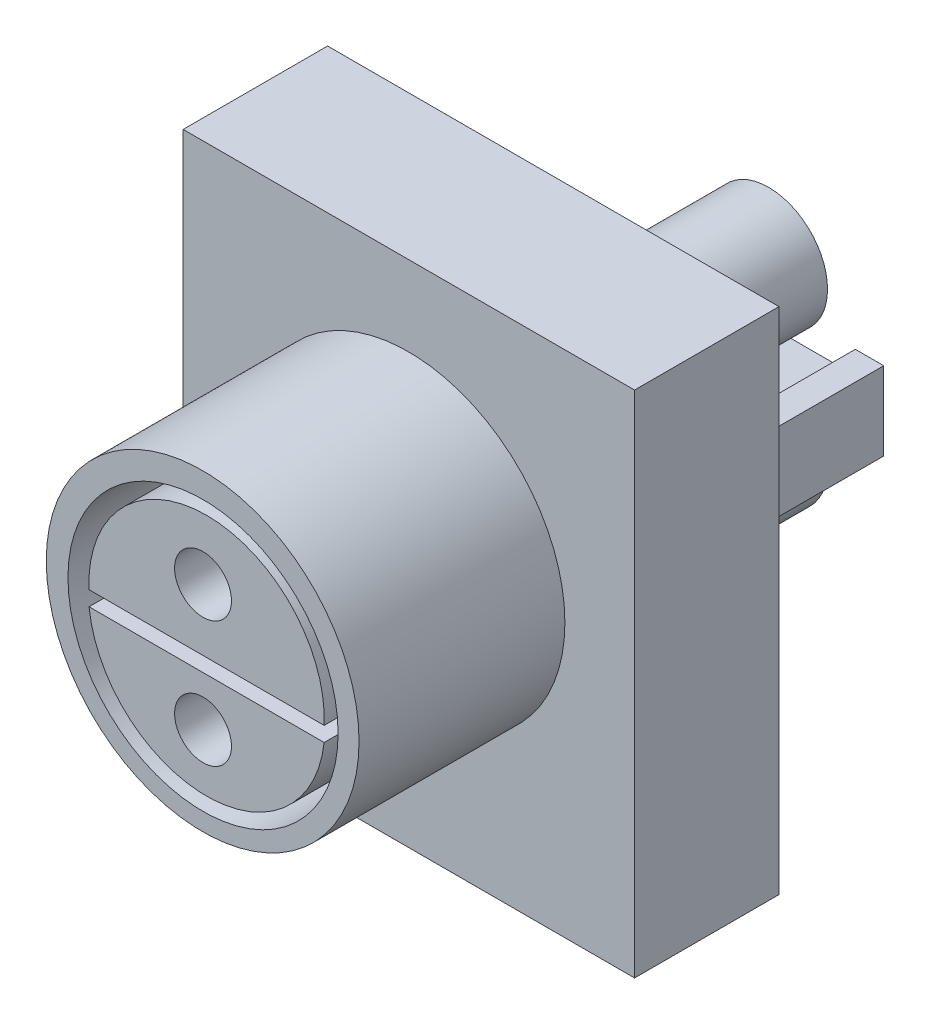
ISO-10303-21;
HEADER;
FILE_DESCRIPTION(('STEP AP214'),'2;1');
FILE_NAME('part.step','',(''),(''),'','','');
FILE_SCHEMA(('AUTOMOTIVE_DESIGN { 1 0 10303 214 1 1 1 1 }'));
ENDSEC;
DATA;
#1=APPLICATION_CONTEXT('core data for automotive mechanical design processes');
#2=APPLICATION_PROTOCOL_DEFINITION('international standard','automotive_design',2000,#1);
#3=PRODUCT_CONTEXT('',#1,'mechanical');
#4=PRODUCT('Part','Part','',(#3));
#5=PRODUCT_RELATED_PRODUCT_CATEGORY('part','',(#4));
#6=PRODUCT_DEFINITION_FORMATION('','',#4);
#7=PRODUCT_DEFINITION_CONTEXT('part definition',#1,'design');
#8=PRODUCT_DEFINITION('design','',#6,#7);
#9=PRODUCT_DEFINITION_SHAPE('','',#8);
#10=(LENGTH_UNIT() NAMED_UNIT(*) SI_UNIT(.MILLI.,.METRE.));
#11=(NAMED_UNIT(*) PLANE_ANGLE_UNIT() SI_UNIT($,.RADIAN.));
#12=(NAMED_UNIT(*) SI_UNIT($,.STERADIAN.) SOLID_ANGLE_UNIT());
#13=UNCERTAINTY_MEASURE_WITH_UNIT(LENGTH_MEASURE(1.E-05),#10,'distance_accuracy_value','');
#14=(GEOMETRIC_REPRESENTATION_CONTEXT(3) GLOBAL_UNCERTAINTY_ASSIGNED_CONTEXT((#13)) GLOBAL_UNIT_ASSIGNED_CONTEXT((#10,
#11,#12)) REPRESENTATION_CONTEXT('',''));
#15=CARTESIAN_POINT('',(0.,0.,0.));
#16=DIRECTION('',(0.,0.,1.));
#17=DIRECTION('',(1.,0.,0.));
#18=AXIS2_PLACEMENT_3D('',#15,#16,#17);
#19=CARTESIAN_POINT('',(-8.,-2.75,-15.24));
#20=DIRECTION('',(0.,1.,0.));
#21=DIRECTION('',(-1.,0.,0.));
#22=AXIS2_PLACEMENT_3D('',#19,#20,#21);
#23=PLANE('',#22);
#24=DIRECTION('',(0.,0.,1.));
#25=VECTOR('',#24,1.);
#26=CARTESIAN_POINT('',(-3.20212539960282,-2.75,-15.15));
#27=LINE('',#26,#25);
#28=CARTESIAN_POINT('',(-3.20212539960282,-2.75,0.));
#29=VERTEX_POINT('',#28);
#30=CARTESIAN_POINT('',(-3.20212539960282,-2.75,-0.0899999999999981));
#31=VERTEX_POINT('',#30);
#32=EDGE_CURVE('E57',#29,#31,#27,.F.);
#33=ORIENTED_EDGE('',*,*,#32,.F.);
#34=DIRECTION('',(-1.,0.,0.));
#35=VECTOR('',#34,1.);
#36=CARTESIAN_POINT('',(-8.,-2.75,0.));
#37=LINE('',#36,#35);
#38=CARTESIAN_POINT('',(-8.,-2.75,0.));
#39=VERTEX_POINT('',#38);
#40=EDGE_CURVE('E363',#29,#39,#37,.T.);
#41=ORIENTED_EDGE('',*,*,#40,.T.);
#42=DIRECTION('',(0.,0.,1.));
#43=VECTOR('',#42,1.);
#44=CARTESIAN_POINT('',(-8.,-2.75,-15.24));
#45=LINE('',#44,#43);
#46=CARTESIAN_POINT('',(-8.,-2.75,-15.24));
#47=VERTEX_POINT('',#46);
#48=EDGE_CURVE('E376',#47,#39,#45,.T.);
#49=ORIENTED_EDGE('',*,*,#48,.F.);
#50=DIRECTION('',(-1.,0.,0.));
#51=VECTOR('',#50,1.);
#52=CARTESIAN_POINT('',(-8.,-2.75,-15.24));
#53=LINE('',#52,#51);
#54=CARTESIAN_POINT('',(-6.,-2.75,-15.24));
#55=VERTEX_POINT('',#54);
#56=EDGE_CURVE('E349',#55,#47,#53,.T.);
#57=ORIENTED_EDGE('',*,*,#56,.F.);
#58=DIRECTION('',(0.,0.,-1.));
#59=VECTOR('',#58,1.);
#60=CARTESIAN_POINT('',(-6.,-2.75,-0.0899999999999981));
#61=LINE('',#60,#59);
#62=CARTESIAN_POINT('',(-6.,-2.75,-0.0899999999999981));
#63=VERTEX_POINT('',#62);
#64=EDGE_CURVE('E248',#63,#55,#61,.T.);
#65=ORIENTED_EDGE('',*,*,#64,.F.);
#66=DIRECTION('',(-1.,0.,0.));
#67=VECTOR('',#66,1.);
#68=CARTESIAN_POINT('',(-6.,-2.75,-0.0899999999999981));
#69=LINE('',#68,#67);
#70=EDGE_CURVE('E213',#31,#63,#69,.T.);
#71=ORIENTED_EDGE('',*,*,#70,.F.);
#72=EDGE_LOOP('',(#33,#41,#49,#57,#65,#71));
#73=FACE_BOUND('',#72,.T.);
#74=ADVANCED_FACE('F42',(#73),#23,.F.);
#75=DIRECTION('',(0.,0.,1.));
#76=VECTOR('',#75,1.);
#77=CARTESIAN_POINT('',(3.20212539960282,-2.75,-15.15));
#78=LINE('',#77,#76);
#79=CARTESIAN_POINT('',(3.20212539960282,-2.75,-0.0899999999999981));
#80=VERTEX_POINT('',#79);
#81=CARTESIAN_POINT('',(3.20212539960282,-2.75,0.));
#82=VERTEX_POINT('',#81);
#83=EDGE_CURVE('E216',#80,#82,#78,.T.);
#84=ORIENTED_EDGE('',*,*,#83,.F.);
#85=CARTESIAN_POINT('',(6.,-2.75,-0.0899999999999981));
#86=VERTEX_POINT('',#85);
#87=EDGE_CURVE('E204',#86,#80,#69,.T.);
#88=ORIENTED_EDGE('',*,*,#87,.F.);
#89=DIRECTION('',(0.,0.,-1.));
#90=VECTOR('',#89,1.);
#91=CARTESIAN_POINT('',(6.,-2.75,-0.0899999999999981));
#92=LINE('',#91,#90);
#93=CARTESIAN_POINT('',(6.,-2.75,-15.24));
#94=VERTEX_POINT('',#93);
#95=EDGE_CURVE('E256',#86,#94,#92,.T.);
#96=ORIENTED_EDGE('',*,*,#95,.T.);
#97=CARTESIAN_POINT('',(8.,-2.75,-15.24));
#98=VERTEX_POINT('',#97);
#99=EDGE_CURVE('E351',#98,#94,#53,.T.);
#100=ORIENTED_EDGE('',*,*,#99,.F.);
#101=DIRECTION('',(0.,0.,1.));
#102=VECTOR('',#101,1.);
#103=CARTESIAN_POINT('',(8.,-2.75,-15.24));
#104=LINE('',#103,#102);
#105=CARTESIAN_POINT('',(8.,-2.75,0.));
#106=VERTEX_POINT('',#105);
#107=EDGE_CURVE('E379',#98,#106,#104,.T.);
#108=ORIENTED_EDGE('',*,*,#107,.T.);
#109=EDGE_CURVE('E219',#106,#82,#37,.T.);
#110=ORIENTED_EDGE('',*,*,#109,.T.);
#111=EDGE_LOOP('',(#84,#88,#96,#100,#108,#110));
#112=FACE_BOUND('',#111,.T.);
#113=ADVANCED_FACE('F217',(#112),#23,.F.);
#114=CARTESIAN_POINT('',(-8.,2.75,-15.24));
#115=DIRECTION('',(0.,-1.,0.));
#116=DIRECTION('',(1.,0.,0.));
#117=AXIS2_PLACEMENT_3D('',#114,#115,#116);
#118=PLANE('',#117);
#119=DIRECTION('',(0.,0.,1.));
#120=VECTOR('',#119,1.);
#121=CARTESIAN_POINT('',(3.06791110155859,2.75,-15.15));
#122=LINE('',#121,#120);
#123=CARTESIAN_POINT('',(3.06791110155859,2.75,0.));
#124=VERTEX_POINT('',#123);
#125=CARTESIAN_POINT('',(3.06791110155859,2.75,-0.0899999999999981));
#126=VERTEX_POINT('',#125);
#127=EDGE_CURVE('E240',#124,#126,#122,.F.);
#128=ORIENTED_EDGE('',*,*,#127,.F.);
#129=DIRECTION('',(1.,0.,0.));
#130=VECTOR('',#129,1.);
#131=CARTESIAN_POINT('',(-8.,2.75,0.));
#132=LINE('',#131,#130);
#133=CARTESIAN_POINT('',(8.,2.75,0.));
#134=VERTEX_POINT('',#133);
#135=EDGE_CURVE('E368',#124,#134,#132,.T.);
#136=ORIENTED_EDGE('',*,*,#135,.T.);
#137=DIRECTION('',(0.,0.,1.));
#138=VECTOR('',#137,1.);
#139=CARTESIAN_POINT('',(8.,2.75,-15.24));
#140=LINE('',#139,#138);
#141=CARTESIAN_POINT('',(8.,2.75,-15.24));
#142=VERTEX_POINT('',#141);
#143=EDGE_CURVE('E360',#142,#134,#140,.T.);
#144=ORIENTED_EDGE('',*,*,#143,.F.);
#145=DIRECTION('',(1.,0.,0.));
#146=VECTOR('',#145,1.);
#147=CARTESIAN_POINT('',(-8.,2.75,-15.24));
#148=LINE('',#147,#146);
#149=CARTESIAN_POINT('',(6.,2.75,-15.24));
#150=VERTEX_POINT('',#149);
#151=EDGE_CURVE('E356',#150,#142,#148,.T.);
#152=ORIENTED_EDGE('',*,*,#151,.F.);
#153=DIRECTION('',(0.,0.,-1.));
#154=VECTOR('',#153,1.);
#155=CARTESIAN_POINT('',(6.,2.75,-0.0899999999999981));
#156=LINE('',#155,#154);
#157=CARTESIAN_POINT('',(6.,2.75,-0.0899999999999981));
#158=VERTEX_POINT('',#157);
#159=EDGE_CURVE('E277',#158,#150,#156,.T.);
#160=ORIENTED_EDGE('',*,*,#159,.F.);
#161=DIRECTION('',(1.,0.,0.));
#162=VECTOR('',#161,1.);
#163=CARTESIAN_POINT('',(-6.,2.75,-0.0899999999999981));
#164=LINE('',#163,#162);
#165=EDGE_CURVE('E268',#126,#158,#164,.T.);
#166=ORIENTED_EDGE('',*,*,#165,.F.);
#167=EDGE_LOOP('',(#128,#136,#144,#152,#160,#166));
#168=FACE_BOUND('',#167,.T.);
#169=ADVANCED_FACE('F427',(#168),#118,.F.);
#170=DIRECTION('',(0.,0.,1.));
#171=VECTOR('',#170,1.);
#172=CARTESIAN_POINT('',(-3.06791110155859,2.75,-15.15));
#173=LINE('',#172,#171);
#174=CARTESIAN_POINT('',(-3.06791110155859,2.75,-0.0899999999999981));
#175=VERTEX_POINT('',#174);
#176=CARTESIAN_POINT('',(-3.06791110155859,2.75,0.));
#177=VERTEX_POINT('',#176);
#178=EDGE_CURVE('E237',#175,#177,#173,.T.);
#179=ORIENTED_EDGE('',*,*,#178,.F.);
#180=CARTESIAN_POINT('',(-6.,2.75,-0.0899999999999981));
#181=VERTEX_POINT('',#180);
#182=EDGE_CURVE('E264',#181,#175,#164,.T.);
#183=ORIENTED_EDGE('',*,*,#182,.F.);
#184=DIRECTION('',(0.,0.,-1.));
#185=VECTOR('',#184,1.);
#186=CARTESIAN_POINT('',(-6.,2.75,-0.0899999999999981));
#187=LINE('',#186,#185);
#188=CARTESIAN_POINT('',(-6.,2.75,-15.24));
#189=VERTEX_POINT('',#188);
#190=EDGE_CURVE('E285',#181,#189,#187,.T.);
#191=ORIENTED_EDGE('',*,*,#190,.T.);
#192=CARTESIAN_POINT('',(-8.,2.75,-15.24));
#193=VERTEX_POINT('',#192);
#194=EDGE_CURVE('E357',#193,#189,#148,.T.);
#195=ORIENTED_EDGE('',*,*,#194,.F.);
#196=DIRECTION('',(0.,0.,1.));
#197=VECTOR('',#196,1.);
#198=CARTESIAN_POINT('',(-8.,2.75,-15.24));
#199=LINE('',#198,#197);
#200=CARTESIAN_POINT('',(-8.,2.75,0.));
#201=VERTEX_POINT('',#200);
#202=EDGE_CURVE('E373',#193,#201,#199,.T.);
#203=ORIENTED_EDGE('',*,*,#202,.T.);
#204=EDGE_CURVE('E350',#201,#177,#132,.T.);
#205=ORIENTED_EDGE('',*,*,#204,.T.);
#206=EDGE_LOOP('',(#179,#183,#191,#195,#203,#205));
#207=FACE_BOUND('',#206,.T.);
#208=ADVANCED_FACE('F447',(#207),#118,.F.);
#209=CARTESIAN_POINT('',(0.,0.,0.));
#210=DIRECTION('',(0.,0.,1.));
#211=DIRECTION('',(1.,0.,0.));
#212=AXIS2_PLACEMENT_3D('',#209,#210,#211);
#213=PLANE('',#212);
#214=CARTESIAN_POINT('',(0.,-5.36622207108236,0.));
#215=DIRECTION('',(0.,0.,-1.));
#216=DIRECTION('',(-1.,0.,0.));
#217=AXIS2_PLACEMENT_3D('',#214,#215,#216);
#218=CIRCLE('',#217,4.135);
#219=EDGE_CURVE('E64',#82,#29,#218,.T.);
#220=ORIENTED_EDGE('',*,*,#219,.F.);
#221=ORIENTED_EDGE('',*,*,#109,.F.);
#222=DIRECTION('',(0.,-1.,0.));
#223=VECTOR('',#222,1.);
#224=CARTESIAN_POINT('',(8.,-2.75,0.));
#225=LINE('',#224,#223);
#226=EDGE_CURVE('E343',#134,#106,#225,.T.);
#227=ORIENTED_EDGE('',*,*,#226,.F.);
#228=ORIENTED_EDGE('',*,*,#135,.F.);
#229=CARTESIAN_POINT('',(0.,5.52355462633182,0.));
#230=DIRECTION('',(0.,0.,-1.));
#231=DIRECTION('',(-1.,0.,0.));
#232=AXIS2_PLACEMENT_3D('',#229,#230,#231);
#233=CIRCLE('',#232,4.13578091686601);
#234=EDGE_CURVE('E232',#177,#124,#233,.T.);
#235=ORIENTED_EDGE('',*,*,#234,.F.);
#236=ORIENTED_EDGE('',*,*,#204,.F.);
#237=DIRECTION('',(0.,1.,0.));
#238=VECTOR('',#237,1.);
#239=CARTESIAN_POINT('',(-8.,-2.75,0.));
#240=LINE('',#239,#238);
#241=EDGE_CURVE('E365',#39,#201,#240,.T.);
#242=ORIENTED_EDGE('',*,*,#241,.F.);
#243=ORIENTED_EDGE('',*,*,#40,.F.);
#244=EDGE_LOOP('',(#220,#221,#227,#228,#235,#236,#242,#243));
#245=FACE_BOUND('',#244,.T.);
#246=DIRECTION('',(0.,-1.,0.));
#247=VECTOR('',#246,1.);
#248=CARTESIAN_POINT('',(-15.875,-17.907,0.));
#249=LINE('',#248,#247);
#250=CARTESIAN_POINT('',(-15.875,17.907,0.));
#251=VERTEX_POINT('',#250);
#252=CARTESIAN_POINT('',(-15.875,-17.907,0.));
#253=VERTEX_POINT('',#252);
#254=EDGE_CURVE('E384',#251,#253,#249,.T.);
#255=ORIENTED_EDGE('',*,*,#254,.F.);
#256=DIRECTION('',(-1.,0.,0.));
#257=VECTOR('',#256,1.);
#258=CARTESIAN_POINT('',(15.875,17.907,0.));
#259=LINE('',#258,#257);
#260=CARTESIAN_POINT('',(15.875,17.907,0.));
#261=VERTEX_POINT('',#260);
#262=EDGE_CURVE('E393',#261,#251,#259,.T.);
#263=ORIENTED_EDGE('',*,*,#262,.F.);
#264=DIRECTION('',(0.,1.,0.));
#265=VECTOR('',#264,1.);
#266=CARTESIAN_POINT('',(15.875,-17.907,0.));
#267=LINE('',#266,#265);
#268=CARTESIAN_POINT('',(15.875,-17.907,0.));
#269=VERTEX_POINT('',#268);
#270=EDGE_CURVE('E404',#269,#261,#267,.T.);
#271=ORIENTED_EDGE('',*,*,#270,.F.);
#272=DIRECTION('',(1.,0.,0.));
#273=VECTOR('',#272,1.);
#274=CARTESIAN_POINT('',(15.875,-17.907,0.));
#275=LINE('',#274,#273);
#276=EDGE_CURVE('E402',#253,#269,#275,.T.);
#277=ORIENTED_EDGE('',*,*,#276,.F.);
#278=EDGE_LOOP('',(#255,#263,#271,#277));
#279=FACE_BOUND('',#278,.T.);
#280=ADVANCED_FACE('F457',(#245,#279),#213,.F.);
#281=CARTESIAN_POINT('',(-15.875,-17.907,10.16));
#282=DIRECTION('',(1.,0.,0.));
#283=DIRECTION('',(0.,0.,-1.));
#284=AXIS2_PLACEMENT_3D('',#281,#282,#283);
#285=PLANE('',#284);
#286=ORIENTED_EDGE('',*,*,#254,.T.);
#287=DIRECTION('',(0.,0.,-1.));
#288=VECTOR('',#287,1.);
#289=CARTESIAN_POINT('',(-15.875,-17.907,10.16));
#290=LINE('',#289,#288);
#291=CARTESIAN_POINT('',(-15.875,-17.907,10.16));
#292=VERTEX_POINT('',#291);
#293=EDGE_CURVE('E388',#292,#253,#290,.T.);
#294=ORIENTED_EDGE('',*,*,#293,.F.);
#295=DIRECTION('',(0.,-1.,0.));
#296=VECTOR('',#295,1.);
#297=CARTESIAN_POINT('',(-15.875,-17.907,10.16));
#298=LINE('',#297,#296);
#299=CARTESIAN_POINT('',(-15.875,17.907,10.16));
#300=VERTEX_POINT('',#299);
#301=EDGE_CURVE('E389',#300,#292,#298,.T.);
#302=ORIENTED_EDGE('',*,*,#301,.F.);
#303=DIRECTION('',(0.,0.,-1.));
#304=VECTOR('',#303,1.);
#305=CARTESIAN_POINT('',(-15.875,17.907,10.16));
#306=LINE('',#305,#304);
#307=EDGE_CURVE('E399',#300,#251,#306,.T.);
#308=ORIENTED_EDGE('',*,*,#307,.T.);
#309=EDGE_LOOP('',(#286,#294,#302,#308));
#310=FACE_BOUND('',#309,.T.);
#311=ADVANCED_FACE('F44',(#310),#285,.F.);
#312=CARTESIAN_POINT('',(15.875,-17.907,10.16));
#313=DIRECTION('',(0.,1.,0.));
#314=DIRECTION('',(-1.,0.,0.));
#315=AXIS2_PLACEMENT_3D('',#312,#313,#314);
#316=PLANE('',#315);
#317=ORIENTED_EDGE('',*,*,#276,.T.);
#318=DIRECTION('',(0.,0.,-1.));
#319=VECTOR('',#318,1.);
#320=CARTESIAN_POINT('',(15.875,-17.907,10.16));
#321=LINE('',#320,#319);
#322=CARTESIAN_POINT('',(15.875,-17.907,10.16));
#323=VERTEX_POINT('',#322);
#324=EDGE_CURVE('E412',#323,#269,#321,.T.);
#325=ORIENTED_EDGE('',*,*,#324,.F.);
#326=DIRECTION('',(1.,0.,0.));
#327=VECTOR('',#326,1.);
#328=CARTESIAN_POINT('',(15.875,-17.907,10.16));
#329=LINE('',#328,#327);
#330=EDGE_CURVE('E392',#292,#323,#329,.T.);
#331=ORIENTED_EDGE('',*,*,#330,.F.);
#332=ORIENTED_EDGE('',*,*,#293,.T.);
#333=EDGE_LOOP('',(#317,#325,#331,#332));
#334=FACE_BOUND('',#333,.T.);
#335=ADVANCED_FACE('F509',(#334),#316,.F.);
#336=CARTESIAN_POINT('',(15.875,-17.907,10.16));
#337=DIRECTION('',(-1.,0.,0.));
#338=DIRECTION('',(0.,0.,1.));
#339=AXIS2_PLACEMENT_3D('',#336,#337,#338);
#340=PLANE('',#339);
#341=ORIENTED_EDGE('',*,*,#270,.T.);
#342=DIRECTION('',(0.,0.,-1.));
#343=VECTOR('',#342,1.);
#344=CARTESIAN_POINT('',(15.875,17.907,10.16));
#345=LINE('',#344,#343);
#346=CARTESIAN_POINT('',(15.875,17.907,10.16));
#347=VERTEX_POINT('',#346);
#348=EDGE_CURVE('E409',#347,#261,#345,.T.);
#349=ORIENTED_EDGE('',*,*,#348,.F.);
#350=DIRECTION('',(0.,1.,0.));
#351=VECTOR('',#350,1.);
#352=CARTESIAN_POINT('',(15.875,-17.907,10.16));
#353=LINE('',#352,#351);
#354=EDGE_CURVE('E395',#323,#347,#353,.T.);
#355=ORIENTED_EDGE('',*,*,#354,.F.);
#356=ORIENTED_EDGE('',*,*,#324,.T.);
#357=EDGE_LOOP('',(#341,#349,#355,#356));
#358=FACE_BOUND('',#357,.T.);
#359=ADVANCED_FACE('F506',(#358),#340,.F.);
#360=CARTESIAN_POINT('',(15.875,17.907,10.16));
#361=DIRECTION('',(0.,-1.,0.));
#362=DIRECTION('',(1.,0.,0.));
#363=AXIS2_PLACEMENT_3D('',#360,#361,#362);
#364=PLANE('',#363);
#365=ORIENTED_EDGE('',*,*,#262,.T.);
#366=ORIENTED_EDGE('',*,*,#307,.F.);
#367=DIRECTION('',(-1.,0.,0.));
#368=VECTOR('',#367,1.);
#369=CARTESIAN_POINT('',(15.875,17.907,10.16));
#370=LINE('',#369,#368);
#371=EDGE_CURVE('E397',#347,#300,#370,.T.);
#372=ORIENTED_EDGE('',*,*,#371,.F.);
#373=ORIENTED_EDGE('',*,*,#348,.T.);
#374=EDGE_LOOP('',(#365,#366,#372,#373));
#375=FACE_BOUND('',#374,.T.);
#376=ADVANCED_FACE('F500',(#375),#364,.F.);
#377=CARTESIAN_POINT('',(0.,0.,10.16));
#378=DIRECTION('',(0.,0.,1.));
#379=DIRECTION('',(1.,0.,0.));
#380=AXIS2_PLACEMENT_3D('',#377,#378,#379);
#381=PLANE('',#380);
#382=CARTESIAN_POINT('',(-0.0248242021001488,1.28910760786738,10.16));
#383=DIRECTION('',(0.,0.,1.));
#384=DIRECTION('',(1.,0.,0.));
#385=AXIS2_PLACEMENT_3D('',#382,#383,#384);
#386=CIRCLE('',#385,11.);
#387=CARTESIAN_POINT('',(10.9751757978999,1.28910760786738,10.16));
#388=VERTEX_POINT('',#387);
#389=EDGE_CURVE('E385',#388,#388,#386,.T.);
#390=ORIENTED_EDGE('',*,*,#389,.F.);
#391=EDGE_LOOP('',(#390));
#392=FACE_BOUND('',#391,.T.);
#393=ORIENTED_EDGE('',*,*,#301,.T.);
#394=ORIENTED_EDGE('',*,*,#330,.T.);
#395=ORIENTED_EDGE('',*,*,#354,.T.);
#396=ORIENTED_EDGE('',*,*,#371,.T.);
#397=EDGE_LOOP('',(#393,#394,#395,#396));
#398=FACE_BOUND('',#397,.T.);
#399=ADVANCED_FACE('F496',(#392,#398),#381,.T.);
#400=CARTESIAN_POINT('',(-0.0248242021001488,1.28910760786738,24.638));
#401=DIRECTION('',(0.,0.,-1.));
#402=DIRECTION('',(-1.,0.,0.));
#403=AXIS2_PLACEMENT_3D('',#400,#401,#402);
#404=CYLINDRICAL_SURFACE('',#403,11.);
#405=CARTESIAN_POINT('',(-0.0248242021001488,1.28910760786738,24.638));
#406=DIRECTION('',(0.,0.,1.));
#407=DIRECTION('',(1.,0.,0.));
#408=AXIS2_PLACEMENT_3D('',#405,#406,#407);
#409=CIRCLE('',#408,11.);
#410=CARTESIAN_POINT('',(10.9751757978999,1.28910760786738,24.638));
#411=VERTEX_POINT('',#410);
#412=EDGE_CURVE('E381',#411,#411,#409,.T.);
#413=ORIENTED_EDGE('',*,*,#412,.F.);
#414=EDGE_LOOP('',(#413));
#415=FACE_BOUND('',#414,.T.);
#416=ORIENTED_EDGE('',*,*,#389,.T.);
#417=EDGE_LOOP('',(#416));
#418=FACE_BOUND('',#417,.T.);
#419=ADVANCED_FACE('F490',(#415,#418),#404,.T.);
#420=CARTESIAN_POINT('',(-0.0248242021001488,1.28910760786738,24.638));
#421=DIRECTION('',(0.,0.,1.));
#422=DIRECTION('',(1.,0.,0.));
#423=AXIS2_PLACEMENT_3D('',#420,#421,#422);
#424=PLANE('',#423);
#425=CARTESIAN_POINT('',(0.,1.03970552627236,24.638));
#426=DIRECTION('',(0.,0.,1.));
#427=DIRECTION('',(1.,0.,0.));
#428=AXIS2_PLACEMENT_3D('',#425,#426,#427);
#429=CIRCLE('',#428,9.5);
#430=CARTESIAN_POINT('',(9.5,1.03970552627236,24.638));
#431=VERTEX_POINT('',#430);
#432=EDGE_CURVE('E338',#431,#431,#429,.T.);
#433=ORIENTED_EDGE('',*,*,#432,.F.);
#434=EDGE_LOOP('',(#433));
#435=FACE_BOUND('',#434,.T.);
#436=ORIENTED_EDGE('',*,*,#412,.T.);
#437=EDGE_LOOP('',(#436));
#438=FACE_BOUND('',#437,.T.);
#439=ADVANCED_FACE('F486',(#435,#438),#424,.T.);
#440=CARTESIAN_POINT('',(8.,-2.75,-15.24));
#441=DIRECTION('',(-1.,0.,0.));
#442=DIRECTION('',(0.,0.,1.));
#443=AXIS2_PLACEMENT_3D('',#440,#441,#442);
#444=PLANE('',#443);
#445=ORIENTED_EDGE('',*,*,#226,.T.);
#446=ORIENTED_EDGE('',*,*,#107,.F.);
#447=DIRECTION('',(0.,-1.,0.));
#448=VECTOR('',#447,1.);
#449=CARTESIAN_POINT('',(8.,-2.75,-15.24));
#450=LINE('',#449,#448);
#451=EDGE_CURVE('E346',#142,#98,#450,.T.);
#452=ORIENTED_EDGE('',*,*,#451,.F.);
#453=ORIENTED_EDGE('',*,*,#143,.T.);
#454=EDGE_LOOP('',(#445,#446,#452,#453));
#455=FACE_BOUND('',#454,.T.);
#456=ADVANCED_FACE('F483',(#455),#444,.F.);
#457=CARTESIAN_POINT('',(-8.,-2.75,-15.24));
#458=DIRECTION('',(1.,0.,0.));
#459=DIRECTION('',(0.,0.,-1.));
#460=AXIS2_PLACEMENT_3D('',#457,#458,#459);
#461=PLANE('',#460);
#462=ORIENTED_EDGE('',*,*,#241,.T.);
#463=ORIENTED_EDGE('',*,*,#202,.F.);
#464=DIRECTION('',(0.,1.,0.));
#465=VECTOR('',#464,1.);
#466=CARTESIAN_POINT('',(-8.,-2.75,-15.24));
#467=LINE('',#466,#465);
#468=EDGE_CURVE('E354',#47,#193,#467,.T.);
#469=ORIENTED_EDGE('',*,*,#468,.F.);
#470=ORIENTED_EDGE('',*,*,#48,.T.);
#471=EDGE_LOOP('',(#462,#463,#469,#470));
#472=FACE_BOUND('',#471,.T.);
#473=ADVANCED_FACE('F454',(#472),#461,.F.);
#474=CARTESIAN_POINT('',(0.,0.,-15.24));
#475=DIRECTION('',(0.,0.,-1.));
#476=DIRECTION('',(-1.,0.,0.));
#477=AXIS2_PLACEMENT_3D('',#474,#475,#476);
#478=PLANE('',#477);
#479=DIRECTION('',(0.,-1.,0.));
#480=VECTOR('',#479,1.);
#481=CARTESIAN_POINT('',(6.,-2.75,-15.24));
#482=LINE('',#481,#480);
#483=CARTESIAN_POINT('',(6.,-1.15,-15.24));
#484=VERTEX_POINT('',#483);
#485=EDGE_CURVE('E254',#484,#94,#482,.T.);
#486=ORIENTED_EDGE('',*,*,#485,.F.);
#487=DIRECTION('',(1.,0.,0.));
#488=VECTOR('',#487,1.);
#489=CARTESIAN_POINT('',(6.,-1.15,-15.24));
#490=LINE('',#489,#488);
#491=CARTESIAN_POINT('',(-6.,-1.15,-15.24));
#492=VERTEX_POINT('',#491);
#493=EDGE_CURVE('E251',#492,#484,#490,.T.);
#494=ORIENTED_EDGE('',*,*,#493,.F.);
#495=DIRECTION('',(0.,1.,0.));
#496=VECTOR('',#495,1.);
#497=CARTESIAN_POINT('',(-6.,-1.15,-15.24));
#498=LINE('',#497,#496);
#499=EDGE_CURVE('E241',#55,#492,#498,.T.);
#500=ORIENTED_EDGE('',*,*,#499,.F.);
#501=ORIENTED_EDGE('',*,*,#56,.T.);
#502=ORIENTED_EDGE('',*,*,#468,.T.);
#503=ORIENTED_EDGE('',*,*,#194,.T.);
#504=DIRECTION('',(0.,1.,0.));
#505=VECTOR('',#504,1.);
#506=CARTESIAN_POINT('',(-6.,1.15,-15.24));
#507=LINE('',#506,#505);
#508=CARTESIAN_POINT('',(-6.,1.15,-15.24));
#509=VERTEX_POINT('',#508);
#510=EDGE_CURVE('E283',#509,#189,#507,.T.);
#511=ORIENTED_EDGE('',*,*,#510,.F.);
#512=DIRECTION('',(-1.,0.,0.));
#513=VECTOR('',#512,1.);
#514=CARTESIAN_POINT('',(6.,1.15,-15.24));
#515=LINE('',#514,#513);
#516=CARTESIAN_POINT('',(6.,1.15,-15.24));
#517=VERTEX_POINT('',#516);
#518=EDGE_CURVE('E280',#517,#509,#515,.T.);
#519=ORIENTED_EDGE('',*,*,#518,.F.);
#520=DIRECTION('',(0.,-1.,0.));
#521=VECTOR('',#520,1.);
#522=CARTESIAN_POINT('',(6.,2.75,-15.24));
#523=LINE('',#522,#521);
#524=EDGE_CURVE('E258',#150,#517,#523,.T.);
#525=ORIENTED_EDGE('',*,*,#524,.F.);
#526=ORIENTED_EDGE('',*,*,#151,.T.);
#527=ORIENTED_EDGE('',*,*,#451,.T.);
#528=ORIENTED_EDGE('',*,*,#99,.T.);
#529=EDGE_LOOP('',(#486,#494,#500,#501,#502,#503,#511,#519,#525,#526,#527,#528));
#530=FACE_BOUND('',#529,.T.);
#531=ADVANCED_FACE('F437',(#530),#478,.T.);
#532=CARTESIAN_POINT('',(0.,1.03970552627236,16.138));
#533=DIRECTION('',(0.,0.,1.));
#534=DIRECTION('',(1.,0.,0.));
#535=AXIS2_PLACEMENT_3D('',#532,#533,#534);
#536=CYLINDRICAL_SURFACE('',#535,9.5);
#537=CARTESIAN_POINT('',(0.,1.03970552627236,16.138));
#538=DIRECTION('',(0.,0.,1.));
#539=DIRECTION('',(1.,0.,0.));
#540=AXIS2_PLACEMENT_3D('',#537,#538,#539);
#541=CIRCLE('',#540,9.5);
#542=CARTESIAN_POINT('',(9.5,1.03970552627236,16.138));
#543=VERTEX_POINT('',#542);
#544=EDGE_CURVE('E340',#543,#543,#541,.T.);
#545=ORIENTED_EDGE('',*,*,#544,.F.);
#546=EDGE_LOOP('',(#545));
#547=FACE_BOUND('',#546,.T.);
#548=ORIENTED_EDGE('',*,*,#432,.T.);
#549=EDGE_LOOP('',(#548));
#550=FACE_BOUND('',#549,.T.);
#551=ADVANCED_FACE('F648',(#547,#550),#536,.F.);
#552=CARTESIAN_POINT('',(0.,1.03970552627236,16.138));
#553=DIRECTION('',(0.,0.,1.));
#554=DIRECTION('',(1.,0.,0.));
#555=AXIS2_PLACEMENT_3D('',#552,#553,#554);
#556=PLANE('',#555);
#557=DIRECTION('',(-1.,0.,0.));
#558=VECTOR('',#557,1.);
#559=CARTESIAN_POINT('',(-8.01579421867933,0.,16.138));
#560=LINE('',#559,#558);
#561=CARTESIAN_POINT('',(8.5188775378433,0.,16.138));
#562=VERTEX_POINT('',#561);
#563=CARTESIAN_POINT('',(-8.01579421867933,0.,16.138));
#564=VERTEX_POINT('',#563);
#565=EDGE_CURVE('E309',#562,#564,#560,.T.);
#566=ORIENTED_EDGE('',*,*,#565,.F.);
#567=CARTESIAN_POINT('',(0.251541659581984,0.91359011886552,16.138));
#568=DIRECTION('',(0.,0.,1.));
#569=DIRECTION('',(1.,0.,0.));
#570=AXIS2_PLACEMENT_3D('',#567,#568,#569);
#571=CIRCLE('',#570,8.3176612956573);
#572=EDGE_CURVE('E306',#564,#562,#571,.T.);
#573=ORIENTED_EDGE('',*,*,#572,.F.);
#574=EDGE_LOOP('',(#566,#573));
#575=FACE_BOUND('',#574,.T.);
#576=DIRECTION('',(1.,0.,0.));
#577=VECTOR('',#576,1.);
#578=CARTESIAN_POINT('',(-8.01579421867933,1.03970552627236,16.138));
#579=LINE('',#578,#577);
#580=CARTESIAN_POINT('',(-8.01579421867933,1.03970552627236,16.138));
#581=VERTEX_POINT('',#580);
#582=CARTESIAN_POINT('',(8.5188775378433,1.03970552627236,16.138));
#583=VERTEX_POINT('',#582);
#584=EDGE_CURVE('E326',#581,#583,#579,.T.);
#585=ORIENTED_EDGE('',*,*,#584,.F.);
#586=CARTESIAN_POINT('',(0.251541659581984,1.43028832367053,16.138));
#587=DIRECTION('',(0.,0.,1.));
#588=DIRECTION('',(-1.,0.,0.));
#589=AXIS2_PLACEMENT_3D('',#586,#587,#588);
#590=CIRCLE('',#589,8.27655710096959);
#591=EDGE_CURVE('E323',#583,#581,#590,.T.);
#592=ORIENTED_EDGE('',*,*,#591,.F.);
#593=EDGE_LOOP('',(#585,#592));
#594=FACE_BOUND('',#593,.T.);
#595=ORIENTED_EDGE('',*,*,#544,.T.);
#596=EDGE_LOOP('',(#595));
#597=FACE_BOUND('',#596,.T.);
#598=ADVANCED_FACE('F653',(#575,#594,#597),#556,.T.);
#599=CARTESIAN_POINT('',(0.251541659581984,1.43028832367053,16.138));
#600=DIRECTION('',(0.,0.,1.));
#601=DIRECTION('',(1.,0.,0.));
#602=AXIS2_PLACEMENT_3D('',#599,#600,#601);
#603=CYLINDRICAL_SURFACE('',#602,8.27655710096959);
#604=CARTESIAN_POINT('',(0.251541659581984,1.43028832367053,24.638));
#605=DIRECTION('',(0.,0.,1.));
#606=DIRECTION('',(-1.,0.,0.));
#607=AXIS2_PLACEMENT_3D('',#604,#605,#606);
#608=CIRCLE('',#607,8.27655710096959);
#609=CARTESIAN_POINT('',(8.5188775378433,1.03970552627236,24.638));
#610=VERTEX_POINT('',#609);
#611=CARTESIAN_POINT('',(-8.01579421867933,1.03970552627236,24.638));
#612=VERTEX_POINT('',#611);
#613=EDGE_CURVE('E321',#610,#612,#608,.T.);
#614=ORIENTED_EDGE('',*,*,#613,.F.);
#615=DIRECTION('',(0.,0.,1.));
#616=VECTOR('',#615,1.);
#617=CARTESIAN_POINT('',(8.5188775378433,1.03970552627236,16.138));
#618=LINE('',#617,#616);
#619=EDGE_CURVE('E335',#583,#610,#618,.T.);
#620=ORIENTED_EDGE('',*,*,#619,.F.);
#621=ORIENTED_EDGE('',*,*,#591,.T.);
#622=DIRECTION('',(0.,0.,1.));
#623=VECTOR('',#622,1.);
#624=CARTESIAN_POINT('',(-8.01579421867933,1.03970552627236,16.138));
#625=LINE('',#624,#623);
#626=EDGE_CURVE('E330',#581,#612,#625,.T.);
#627=ORIENTED_EDGE('',*,*,#626,.T.);
#628=EDGE_LOOP('',(#614,#620,#621,#627));
#629=FACE_BOUND('',#628,.T.);
#630=ADVANCED_FACE('F687',(#629),#603,.T.);
#631=CARTESIAN_POINT('',(-8.01579421867933,1.03970552627236,16.138));
#632=DIRECTION('',(0.,-1.,0.));
#633=DIRECTION('',(0.,0.,-1.));
#634=AXIS2_PLACEMENT_3D('',#631,#632,#633);
#635=PLANE('',#634);
#636=DIRECTION('',(1.,0.,0.));
#637=VECTOR('',#636,1.);
#638=CARTESIAN_POINT('',(-8.01579421867933,1.03970552627236,24.638));
#639=LINE('',#638,#637);
#640=EDGE_CURVE('E327',#612,#610,#639,.T.);
#641=ORIENTED_EDGE('',*,*,#640,.F.);
#642=ORIENTED_EDGE('',*,*,#626,.F.);
#643=ORIENTED_EDGE('',*,*,#584,.T.);
#644=ORIENTED_EDGE('',*,*,#619,.T.);
#645=EDGE_LOOP('',(#641,#642,#643,#644));
#646=FACE_BOUND('',#645,.T.);
#647=ADVANCED_FACE('F669',(#646),#635,.T.);
#648=CARTESIAN_POINT('',(0.251541659581984,0.91359011886552,16.138));
#649=DIRECTION('',(0.,0.,1.));
#650=DIRECTION('',(1.,0.,0.));
#651=AXIS2_PLACEMENT_3D('',#648,#649,#650);
#652=CYLINDRICAL_SURFACE('',#651,8.3176612956573);
#653=CARTESIAN_POINT('',(0.251541659581984,0.91359011886552,24.638));
#654=DIRECTION('',(0.,0.,1.));
#655=DIRECTION('',(1.,0.,0.));
#656=AXIS2_PLACEMENT_3D('',#653,#654,#655);
#657=CIRCLE('',#656,8.3176612956573);
#658=CARTESIAN_POINT('',(-8.01579421867933,0.,24.638));
#659=VERTEX_POINT('',#658);
#660=CARTESIAN_POINT('',(8.5188775378433,0.,24.638));
#661=VERTEX_POINT('',#660);
#662=EDGE_CURVE('E303',#659,#661,#657,.T.);
#663=ORIENTED_EDGE('',*,*,#662,.F.);
#664=DIRECTION('',(0.,0.,1.));
#665=VECTOR('',#664,1.);
#666=CARTESIAN_POINT('',(-8.01579421867933,0.,16.138));
#667=LINE('',#666,#665);
#668=EDGE_CURVE('E318',#564,#659,#667,.T.);
#669=ORIENTED_EDGE('',*,*,#668,.F.);
#670=ORIENTED_EDGE('',*,*,#572,.T.);
#671=DIRECTION('',(0.,0.,1.));
#672=VECTOR('',#671,1.);
#673=CARTESIAN_POINT('',(8.5188775378433,0.,16.138));
#674=LINE('',#673,#672);
#675=EDGE_CURVE('E313',#562,#661,#674,.T.);
#676=ORIENTED_EDGE('',*,*,#675,.T.);
#677=EDGE_LOOP('',(#663,#669,#670,#676));
#678=FACE_BOUND('',#677,.T.);
#679=ADVANCED_FACE('F663',(#678),#652,.T.);
#680=CARTESIAN_POINT('',(-8.01579421867933,0.,16.138));
#681=DIRECTION('',(0.,1.,0.));
#682=DIRECTION('',(0.,0.,1.));
#683=AXIS2_PLACEMENT_3D('',#680,#681,#682);
#684=PLANE('',#683);
#685=DIRECTION('',(-1.,0.,0.));
#686=VECTOR('',#685,1.);
#687=CARTESIAN_POINT('',(-8.01579421867933,0.,24.638));
#688=LINE('',#687,#686);
#689=EDGE_CURVE('E310',#661,#659,#688,.T.);
#690=ORIENTED_EDGE('',*,*,#689,.F.);
#691=ORIENTED_EDGE('',*,*,#675,.F.);
#692=ORIENTED_EDGE('',*,*,#565,.T.);
#693=ORIENTED_EDGE('',*,*,#668,.T.);
#694=EDGE_LOOP('',(#690,#691,#692,#693));
#695=FACE_BOUND('',#694,.T.);
#696=ADVANCED_FACE('F668',(#695),#684,.T.);
#697=CARTESIAN_POINT('',(0.,5.36622207108254,24.638));
#698=DIRECTION('',(0.,0.,1.));
#699=DIRECTION('',(1.,0.,0.));
#700=AXIS2_PLACEMENT_3D('',#697,#698,#699);
#701=CIRCLE('',#700,2.);
#702=CARTESIAN_POINT('',(2.,5.36622207108254,24.638));
#703=VERTEX_POINT('',#702);
#704=EDGE_CURVE('E297',#703,#703,#701,.T.);
#705=ORIENTED_EDGE('',*,*,#704,.F.);
#706=EDGE_LOOP('',(#705));
#707=FACE_BOUND('',#706,.T.);
#708=ORIENTED_EDGE('',*,*,#640,.T.);
#709=ORIENTED_EDGE('',*,*,#613,.T.);
#710=EDGE_LOOP('',(#708,#709));
#711=FACE_BOUND('',#710,.T.);
#712=ADVANCED_FACE('F492',(#707,#711),#424,.T.);
#713=CARTESIAN_POINT('',(0.,-3.48804434620341,24.638));
#714=DIRECTION('',(0.,0.,1.));
#715=DIRECTION('',(1.,0.,0.));
#716=AXIS2_PLACEMENT_3D('',#713,#714,#715);
#717=CIRCLE('',#716,2.);
#718=CARTESIAN_POINT('',(2.,-3.48804434620341,24.638));
#719=VERTEX_POINT('',#718);
#720=EDGE_CURVE('E288',#719,#719,#717,.T.);
#721=ORIENTED_EDGE('',*,*,#720,.F.);
#722=EDGE_LOOP('',(#721));
#723=FACE_BOUND('',#722,.T.);
#724=ORIENTED_EDGE('',*,*,#689,.T.);
#725=ORIENTED_EDGE('',*,*,#662,.T.);
#726=EDGE_LOOP('',(#724,#725));
#727=FACE_BOUND('',#726,.T.);
#728=ADVANCED_FACE('F493',(#723,#727),#424,.T.);
#729=CARTESIAN_POINT('',(0.,5.36622207108254,16.138));
#730=DIRECTION('',(0.,0.,1.));
#731=DIRECTION('',(1.,0.,0.));
#732=AXIS2_PLACEMENT_3D('',#729,#730,#731);
#733=CYLINDRICAL_SURFACE('',#732,2.);
#734=CARTESIAN_POINT('',(0.,5.36622207108254,16.138));
#735=DIRECTION('',(0.,0.,1.));
#736=DIRECTION('',(1.,0.,0.));
#737=AXIS2_PLACEMENT_3D('',#734,#735,#736);
#738=CIRCLE('',#737,2.);
#739=CARTESIAN_POINT('',(2.,5.36622207108254,16.138));
#740=VERTEX_POINT('',#739);
#741=EDGE_CURVE('E300',#740,#740,#738,.T.);
#742=ORIENTED_EDGE('',*,*,#741,.F.);
#743=EDGE_LOOP('',(#742));
#744=FACE_BOUND('',#743,.T.);
#745=ORIENTED_EDGE('',*,*,#704,.T.);
#746=EDGE_LOOP('',(#745));
#747=FACE_BOUND('',#746,.T.);
#748=ADVANCED_FACE('F619',(#744,#747),#733,.F.);
#749=CARTESIAN_POINT('',(0.,5.36622207108254,16.138));
#750=DIRECTION('',(0.,0.,1.));
#751=DIRECTION('',(1.,0.,0.));
#752=AXIS2_PLACEMENT_3D('',#749,#750,#751);
#753=PLANE('',#752);
#754=ORIENTED_EDGE('',*,*,#741,.T.);
#755=EDGE_LOOP('',(#754));
#756=FACE_BOUND('',#755,.T.);
#757=ADVANCED_FACE('F624',(#756),#753,.T.);
#758=CARTESIAN_POINT('',(0.,-3.48804434620341,16.138));
#759=DIRECTION('',(0.,0.,1.));
#760=DIRECTION('',(1.,0.,0.));
#761=AXIS2_PLACEMENT_3D('',#758,#759,#760);
#762=CYLINDRICAL_SURFACE('',#761,2.);
#763=CARTESIAN_POINT('',(0.,-3.48804434620341,16.138));
#764=DIRECTION('',(0.,0.,1.));
#765=DIRECTION('',(1.,0.,0.));
#766=AXIS2_PLACEMENT_3D('',#763,#764,#765);
#767=CIRCLE('',#766,2.);
#768=CARTESIAN_POINT('',(2.,-3.48804434620341,16.138));
#769=VERTEX_POINT('',#768);
#770=EDGE_CURVE('E294',#769,#769,#767,.T.);
#771=ORIENTED_EDGE('',*,*,#770,.F.);
#772=EDGE_LOOP('',(#771));
#773=FACE_BOUND('',#772,.T.);
#774=ORIENTED_EDGE('',*,*,#720,.T.);
#775=EDGE_LOOP('',(#774));
#776=FACE_BOUND('',#775,.T.);
#777=ADVANCED_FACE('F634',(#773,#776),#762,.F.);
#778=CARTESIAN_POINT('',(0.,-3.48804434620341,16.138));
#779=DIRECTION('',(0.,0.,1.));
#780=DIRECTION('',(1.,0.,0.));
#781=AXIS2_PLACEMENT_3D('',#778,#779,#780);
#782=PLANE('',#781);
#783=ORIENTED_EDGE('',*,*,#770,.T.);
#784=EDGE_LOOP('',(#783));
#785=FACE_BOUND('',#784,.T.);
#786=ADVANCED_FACE('F639',(#785),#782,.T.);
#787=CARTESIAN_POINT('',(-6.,1.15,-0.0899999999999981));
#788=DIRECTION('',(-1.,0.,0.));
#789=DIRECTION('',(0.,0.,1.));
#790=AXIS2_PLACEMENT_3D('',#787,#788,#789);
#791=PLANE('',#790);
#792=ORIENTED_EDGE('',*,*,#510,.T.);
#793=ORIENTED_EDGE('',*,*,#190,.F.);
#794=DIRECTION('',(0.,1.,0.));
#795=VECTOR('',#794,1.);
#796=CARTESIAN_POINT('',(-6.,1.15,-0.0899999999999981));
#797=LINE('',#796,#795);
#798=CARTESIAN_POINT('',(-6.,1.15,-0.0899999999999981));
#799=VERTEX_POINT('',#798);
#800=EDGE_CURVE('E274',#799,#181,#797,.T.);
#801=ORIENTED_EDGE('',*,*,#800,.F.);
#802=DIRECTION('',(0.,0.,-1.));
#803=VECTOR('',#802,1.);
#804=CARTESIAN_POINT('',(-6.,1.15,-0.0899999999999981));
#805=LINE('',#804,#803);
#806=EDGE_CURVE('E289',#799,#509,#805,.T.);
#807=ORIENTED_EDGE('',*,*,#806,.T.);
#808=EDGE_LOOP('',(#792,#793,#801,#807));
#809=FACE_BOUND('',#808,.T.);
#810=ADVANCED_FACE('F444',(#809),#791,.F.);
#811=CARTESIAN_POINT('',(6.,1.15,-0.0899999999999981));
#812=DIRECTION('',(0.,-1.,0.));
#813=DIRECTION('',(0.,0.,-1.));
#814=AXIS2_PLACEMENT_3D('',#811,#812,#813);
#815=PLANE('',#814);
#816=ORIENTED_EDGE('',*,*,#518,.T.);
#817=ORIENTED_EDGE('',*,*,#806,.F.);
#818=DIRECTION('',(-1.,0.,0.));
#819=VECTOR('',#818,1.);
#820=CARTESIAN_POINT('',(6.,1.15,-0.0899999999999981));
#821=LINE('',#820,#819);
#822=CARTESIAN_POINT('',(6.,1.15,-0.0899999999999981));
#823=VERTEX_POINT('',#822);
#824=EDGE_CURVE('E271',#823,#799,#821,.T.);
#825=ORIENTED_EDGE('',*,*,#824,.F.);
#826=DIRECTION('',(0.,0.,-1.));
#827=VECTOR('',#826,1.);
#828=CARTESIAN_POINT('',(6.,1.15,-0.0899999999999981));
#829=LINE('',#828,#827);
#830=EDGE_CURVE('E291',#823,#517,#829,.T.);
#831=ORIENTED_EDGE('',*,*,#830,.T.);
#832=EDGE_LOOP('',(#816,#817,#825,#831));
#833=FACE_BOUND('',#832,.T.);
#834=ADVANCED_FACE('F440',(#833),#815,.F.);
#835=CARTESIAN_POINT('',(6.,2.75,-0.0899999999999981));
#836=DIRECTION('',(1.,0.,0.));
#837=DIRECTION('',(0.,0.,-1.));
#838=AXIS2_PLACEMENT_3D('',#835,#836,#837);
#839=PLANE('',#838);
#840=ORIENTED_EDGE('',*,*,#524,.T.);
#841=ORIENTED_EDGE('',*,*,#830,.F.);
#842=DIRECTION('',(0.,-1.,0.));
#843=VECTOR('',#842,1.);
#844=CARTESIAN_POINT('',(6.,2.75,-0.0899999999999981));
#845=LINE('',#844,#843);
#846=EDGE_CURVE('E267',#158,#823,#845,.T.);
#847=ORIENTED_EDGE('',*,*,#846,.F.);
#848=ORIENTED_EDGE('',*,*,#159,.T.);
#849=EDGE_LOOP('',(#840,#841,#847,#848));
#850=FACE_BOUND('',#849,.T.);
#851=ADVANCED_FACE('F433',(#850),#839,.F.);
#852=CARTESIAN_POINT('',(0.,0.,-0.0899999999999981));
#853=DIRECTION('',(0.,0.,-1.));
#854=DIRECTION('',(-1.,0.,0.));
#855=AXIS2_PLACEMENT_3D('',#852,#853,#854);
#856=PLANE('',#855);
#857=ORIENTED_EDGE('',*,*,#182,.T.);
#858=CARTESIAN_POINT('',(0.,5.52355462633182,-0.0899999999999981));
#859=DIRECTION('',(0.,0.,-1.));
#860=DIRECTION('',(-1.,0.,0.));
#861=AXIS2_PLACEMENT_3D('',#858,#859,#860);
#862=CIRCLE('',#861,4.13578091686601);
#863=EDGE_CURVE('E50',#175,#126,#862,.F.);
#864=ORIENTED_EDGE('',*,*,#863,.T.);
#865=ORIENTED_EDGE('',*,*,#165,.T.);
#866=ORIENTED_EDGE('',*,*,#846,.T.);
#867=ORIENTED_EDGE('',*,*,#824,.T.);
#868=ORIENTED_EDGE('',*,*,#800,.T.);
#869=EDGE_LOOP('',(#857,#864,#865,#866,#867,#868));
#870=FACE_BOUND('',#869,.T.);
#871=ADVANCED_FACE('F419',(#870),#856,.T.);
#872=CARTESIAN_POINT('',(6.,-2.75,-0.0899999999999981));
#873=DIRECTION('',(1.,0.,0.));
#874=DIRECTION('',(0.,0.,-1.));
#875=AXIS2_PLACEMENT_3D('',#872,#873,#874);
#876=PLANE('',#875);
#877=ORIENTED_EDGE('',*,*,#485,.T.);
#878=ORIENTED_EDGE('',*,*,#95,.F.);
#879=DIRECTION('',(0.,-1.,0.));
#880=VECTOR('',#879,1.);
#881=CARTESIAN_POINT('',(6.,-2.75,-0.0899999999999981));
#882=LINE('',#881,#880);
#883=CARTESIAN_POINT('',(6.,-1.15,-0.0899999999999981));
#884=VERTEX_POINT('',#883);
#885=EDGE_CURVE('E209',#884,#86,#882,.T.);
#886=ORIENTED_EDGE('',*,*,#885,.F.);
#887=DIRECTION('',(0.,0.,-1.));
#888=VECTOR('',#887,1.);
#889=CARTESIAN_POINT('',(6.,-1.15,-0.0899999999999981));
#890=LINE('',#889,#888);
#891=EDGE_CURVE('E259',#884,#484,#890,.T.);
#892=ORIENTED_EDGE('',*,*,#891,.T.);
#893=EDGE_LOOP('',(#877,#878,#886,#892));
#894=FACE_BOUND('',#893,.T.);
#895=ADVANCED_FACE('F815',(#894),#876,.F.);
#896=CARTESIAN_POINT('',(6.,-1.15,-0.0899999999999981));
#897=DIRECTION('',(0.,1.,0.));
#898=DIRECTION('',(0.,0.,1.));
#899=AXIS2_PLACEMENT_3D('',#896,#897,#898);
#900=PLANE('',#899);
#901=ORIENTED_EDGE('',*,*,#493,.T.);
#902=ORIENTED_EDGE('',*,*,#891,.F.);
#903=DIRECTION('',(1.,0.,0.));
#904=VECTOR('',#903,1.);
#905=CARTESIAN_POINT('',(6.,-1.15,-0.0899999999999981));
#906=LINE('',#905,#904);
#907=CARTESIAN_POINT('',(-6.,-1.15,-0.0899999999999981));
#908=VERTEX_POINT('',#907);
#909=EDGE_CURVE('E245',#908,#884,#906,.T.);
#910=ORIENTED_EDGE('',*,*,#909,.F.);
#911=DIRECTION('',(0.,0.,-1.));
#912=VECTOR('',#911,1.);
#913=CARTESIAN_POINT('',(-6.,-1.15,-0.0899999999999981));
#914=LINE('',#913,#912);
#915=EDGE_CURVE('E261',#908,#492,#914,.T.);
#916=ORIENTED_EDGE('',*,*,#915,.T.);
#917=EDGE_LOOP('',(#901,#902,#910,#916));
#918=FACE_BOUND('',#917,.T.);
#919=ADVANCED_FACE('F558',(#918),#900,.F.);
#920=CARTESIAN_POINT('',(-6.,-1.15,-0.0899999999999981));
#921=DIRECTION('',(-1.,0.,0.));
#922=DIRECTION('',(0.,0.,1.));
#923=AXIS2_PLACEMENT_3D('',#920,#921,#922);
#924=PLANE('',#923);
#925=ORIENTED_EDGE('',*,*,#499,.T.);
#926=ORIENTED_EDGE('',*,*,#915,.F.);
#927=DIRECTION('',(0.,1.,0.));
#928=VECTOR('',#927,1.);
#929=CARTESIAN_POINT('',(-6.,-1.15,-0.0899999999999981));
#930=LINE('',#929,#928);
#931=EDGE_CURVE('E212',#63,#908,#930,.T.);
#932=ORIENTED_EDGE('',*,*,#931,.F.);
#933=ORIENTED_EDGE('',*,*,#64,.T.);
#934=EDGE_LOOP('',(#925,#926,#932,#933));
#935=FACE_BOUND('',#934,.T.);
#936=ADVANCED_FACE('F472',(#935),#924,.F.);
#937=CARTESIAN_POINT('',(0.,0.,-0.0899999999999981));
#938=DIRECTION('',(0.,0.,1.));
#939=DIRECTION('',(1.,0.,0.));
#940=AXIS2_PLACEMENT_3D('',#937,#938,#939);
#941=PLANE('',#940);
#942=CARTESIAN_POINT('',(0.,-5.36622207108236,-0.0899999999999981));
#943=DIRECTION('',(0.,0.,1.));
#944=DIRECTION('',(1.,0.,0.));
#945=AXIS2_PLACEMENT_3D('',#942,#943,#944);
#946=CIRCLE('',#945,4.135);
#947=EDGE_CURVE('E11',#31,#80,#946,.F.);
#948=ORIENTED_EDGE('',*,*,#947,.F.);
#949=ORIENTED_EDGE('',*,*,#70,.T.);
#950=ORIENTED_EDGE('',*,*,#931,.T.);
#951=ORIENTED_EDGE('',*,*,#909,.T.);
#952=ORIENTED_EDGE('',*,*,#885,.T.);
#953=ORIENTED_EDGE('',*,*,#87,.T.);
#954=EDGE_LOOP('',(#948,#949,#950,#951,#952,#953));
#955=FACE_BOUND('',#954,.T.);
#956=ADVANCED_FACE('F206',(#955),#941,.F.);
#957=CARTESIAN_POINT('',(0.,5.52355462633182,-15.15));
#958=DIRECTION('',(0.,0.,1.));
#959=DIRECTION('',(1.,0.,0.));
#960=AXIS2_PLACEMENT_3D('',#957,#958,#959);
#961=CYLINDRICAL_SURFACE('',#960,4.13578091686601);
#962=CARTESIAN_POINT('',(0.,5.52355462633182,-15.15));
#963=DIRECTION('',(0.,0.,-1.));
#964=DIRECTION('',(-1.,0.,0.));
#965=AXIS2_PLACEMENT_3D('',#962,#963,#964);
#966=CIRCLE('',#965,4.13578091686601);
#967=CARTESIAN_POINT('',(-4.13578091686601,5.52355462633182,-15.15));
#968=VERTEX_POINT('',#967);
#969=EDGE_CURVE('E234',#968,#968,#966,.T.);
#970=ORIENTED_EDGE('',*,*,#969,.F.);
#971=EDGE_LOOP('',(#970));
#972=FACE_BOUND('',#971,.T.);
#973=ORIENTED_EDGE('',*,*,#234,.T.);
#974=ORIENTED_EDGE('',*,*,#127,.T.);
#975=ORIENTED_EDGE('',*,*,#863,.F.);
#976=ORIENTED_EDGE('',*,*,#178,.T.);
#977=EDGE_LOOP('',(#973,#974,#975,#976));
#978=FACE_BOUND('',#977,.T.);
#979=ADVANCED_FACE('F460',(#972,#978),#961,.T.);
#980=CARTESIAN_POINT('',(0.,5.52355462633182,-15.15));
#981=DIRECTION('',(0.,0.,-1.));
#982=DIRECTION('',(-1.,0.,0.));
#983=AXIS2_PLACEMENT_3D('',#980,#981,#982);
#984=PLANE('',#983);
#985=CARTESIAN_POINT('',(0.,5.62808667840045,-15.15));
#986=DIRECTION('',(0.,0.,-1.));
#987=DIRECTION('',(-1.,0.,0.));
#988=AXIS2_PLACEMENT_3D('',#985,#986,#987);
#989=CIRCLE('',#988,3.);
#990=CARTESIAN_POINT('',(-3.,5.62808667840045,-15.15));
#991=VERTEX_POINT('',#990);
#992=EDGE_CURVE('E224',#991,#991,#989,.T.);
#993=ORIENTED_EDGE('',*,*,#992,.F.);
#994=EDGE_LOOP('',(#993));
#995=FACE_BOUND('',#994,.T.);
#996=ORIENTED_EDGE('',*,*,#969,.T.);
#997=EDGE_LOOP('',(#996));
#998=FACE_BOUND('',#997,.T.);
#999=ADVANCED_FACE('F462',(#995,#998),#984,.T.);
#1000=CARTESIAN_POINT('',(0.,5.62808667840045,0.));
#1001=DIRECTION('',(0.,0.,-1.));
#1002=DIRECTION('',(-1.,0.,0.));
#1003=AXIS2_PLACEMENT_3D('',#1000,#1001,#1002);
#1004=CYLINDRICAL_SURFACE('',#1003,3.);
#1005=CARTESIAN_POINT('',(0.,5.62808667840045,0.));
#1006=DIRECTION('',(0.,0.,-1.));
#1007=DIRECTION('',(-1.,0.,0.));
#1008=AXIS2_PLACEMENT_3D('',#1005,#1006,#1007);
#1009=CIRCLE('',#1008,3.);
#1010=CARTESIAN_POINT('',(-3.,5.62808667840045,0.));
#1011=VERTEX_POINT('',#1010);
#1012=EDGE_CURVE('E227',#1011,#1011,#1009,.T.);
#1013=ORIENTED_EDGE('',*,*,#1012,.F.);
#1014=EDGE_LOOP('',(#1013));
#1015=FACE_BOUND('',#1014,.T.);
#1016=ORIENTED_EDGE('',*,*,#992,.T.);
#1017=EDGE_LOOP('',(#1016));
#1018=FACE_BOUND('',#1017,.T.);
#1019=ADVANCED_FACE('F469',(#1015,#1018),#1004,.F.);
#1020=CARTESIAN_POINT('',(0.,5.62808667840045,0.));
#1021=DIRECTION('',(0.,0.,-1.));
#1022=DIRECTION('',(-1.,0.,0.));
#1023=AXIS2_PLACEMENT_3D('',#1020,#1021,#1022);
#1024=PLANE('',#1023);
#1025=ORIENTED_EDGE('',*,*,#1012,.T.);
#1026=EDGE_LOOP('',(#1025));
#1027=FACE_BOUND('',#1026,.T.);
#1028=ADVANCED_FACE('F575',(#1027),#1024,.T.);
#1029=CARTESIAN_POINT('',(0.,-5.36622207108236,-15.15));
#1030=DIRECTION('',(0.,0.,1.));
#1031=DIRECTION('',(1.,0.,0.));
#1032=AXIS2_PLACEMENT_3D('',#1029,#1030,#1031);
#1033=CYLINDRICAL_SURFACE('',#1032,4.135);
#1034=CARTESIAN_POINT('',(0.,-5.36622207108236,-15.15));
#1035=DIRECTION('',(0.,0.,-1.));
#1036=DIRECTION('',(-1.,0.,0.));
#1037=AXIS2_PLACEMENT_3D('',#1034,#1035,#1036);
#1038=CIRCLE('',#1037,4.135);
#1039=CARTESIAN_POINT('',(-4.135,-5.36622207108236,-15.15));
#1040=VERTEX_POINT('',#1039);
#1041=EDGE_CURVE('E221',#1040,#1040,#1038,.T.);
#1042=ORIENTED_EDGE('',*,*,#1041,.F.);
#1043=EDGE_LOOP('',(#1042));
#1044=FACE_BOUND('',#1043,.T.);
#1045=ORIENTED_EDGE('',*,*,#219,.T.);
#1046=ORIENTED_EDGE('',*,*,#32,.T.);
#1047=ORIENTED_EDGE('',*,*,#947,.T.);
#1048=ORIENTED_EDGE('',*,*,#83,.T.);
#1049=EDGE_LOOP('',(#1045,#1046,#1047,#1048));
#1050=FACE_BOUND('',#1049,.T.);
#1051=ADVANCED_FACE('F223',(#1044,#1050),#1033,.T.);
#1052=CARTESIAN_POINT('',(0.,-5.36622207108236,-15.15));
#1053=DIRECTION('',(0.,0.,-1.));
#1054=DIRECTION('',(-1.,0.,0.));
#1055=AXIS2_PLACEMENT_3D('',#1052,#1053,#1054);
#1056=PLANE('',#1055);
#1057=CARTESIAN_POINT('',(0.,-5.36622207108236,-15.15));
#1058=DIRECTION('',(0.,0.,-1.));
#1059=DIRECTION('',(-1.,0.,0.));
#1060=AXIS2_PLACEMENT_3D('',#1057,#1058,#1059);
#1061=CIRCLE('',#1060,3.);
#1062=CARTESIAN_POINT('',(-3.,-5.36622207108236,-15.15));
#1063=VERTEX_POINT('',#1062);
#1064=EDGE_CURVE('E1074',#1063,#1063,#1061,.T.);
#1065=ORIENTED_EDGE('',*,*,#1064,.F.);
#1066=EDGE_LOOP('',(#1065));
#1067=FACE_BOUND('',#1066,.T.);
#1068=ORIENTED_EDGE('',*,*,#1041,.T.);
#1069=EDGE_LOOP('',(#1068));
#1070=FACE_BOUND('',#1069,.T.);
#1071=ADVANCED_FACE('F574',(#1067,#1070),#1056,.T.);
#1072=CARTESIAN_POINT('',(0.,-5.36622207108236,0.));
#1073=DIRECTION('',(0.,0.,-1.));
#1074=DIRECTION('',(-1.,0.,0.));
#1075=AXIS2_PLACEMENT_3D('',#1072,#1073,#1074);
#1076=CYLINDRICAL_SURFACE('',#1075,3.);
#1077=CARTESIAN_POINT('',(0.,-5.36622207108236,0.));
#1078=DIRECTION('',(0.,0.,-1.));
#1079=DIRECTION('',(-1.,0.,0.));
#1080=AXIS2_PLACEMENT_3D('',#1077,#1078,#1079);
#1081=CIRCLE('',#1080,3.);
#1082=CARTESIAN_POINT('',(-3.,-5.36622207108236,0.));
#1083=VERTEX_POINT('',#1082);
#1084=EDGE_CURVE('E1073',#1083,#1083,#1081,.T.);
#1085=ORIENTED_EDGE('',*,*,#1084,.F.);
#1086=EDGE_LOOP('',(#1085));
#1087=FACE_BOUND('',#1086,.T.);
#1088=ORIENTED_EDGE('',*,*,#1064,.T.);
#1089=EDGE_LOOP('',(#1088));
#1090=FACE_BOUND('',#1089,.T.);
#1091=ADVANCED_FACE('F586',(#1087,#1090),#1076,.F.);
#1092=CARTESIAN_POINT('',(0.,-5.36622207108236,0.));
#1093=DIRECTION('',(0.,0.,-1.));
#1094=DIRECTION('',(-1.,0.,0.));
#1095=AXIS2_PLACEMENT_3D('',#1092,#1093,#1094);
#1096=PLANE('',#1095);
#1097=ORIENTED_EDGE('',*,*,#1084,.T.);
#1098=EDGE_LOOP('',(#1097));
#1099=FACE_BOUND('',#1098,.T.);
#1100=ADVANCED_FACE('F611',(#1099),#1096,.T.);
#1101=CLOSED_SHELL('',(#74,#113,#169,#208,#280,#311,#335,#359,#376,#399,#419,#439,#456,#473,
#531,#551,#598,#630,#647,#679,#696,#712,#728,#748,#757,#777,#786,#810,#834,#851,#871,#895,#919,
#936,#956,#979,#999,#1019,#1028,#1051,#1071,#1091,#1100));
#1102=MANIFOLD_SOLID_BREP('B2',#1101);
#1103=ADVANCED_BREP_SHAPE_REPRESENTATION('',(#18,#1102),#14);
#1104=SHAPE_DEFINITION_REPRESENTATION(#9,#1103);
ENDSEC;
END-ISO-10303-21;
